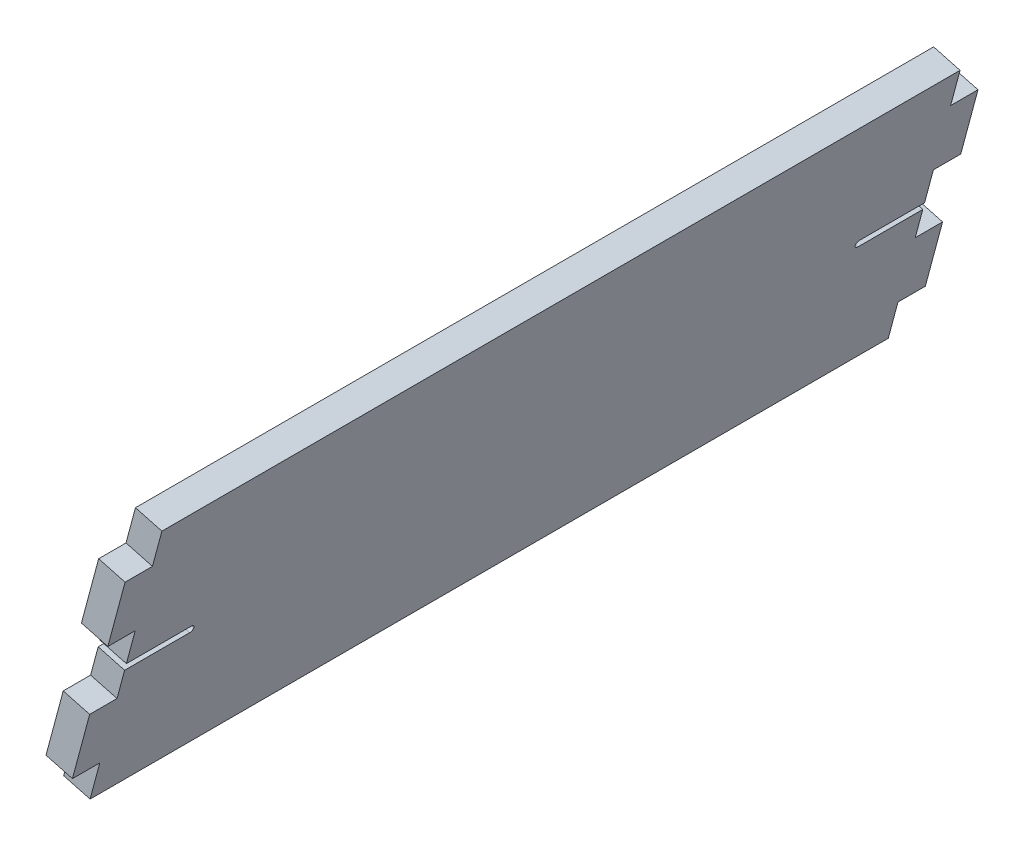
ISO-10303-21;
HEADER;
FILE_DESCRIPTION(('STEP AP214'),'2;1');
FILE_NAME('part.step','',(''),(''),'','','');
FILE_SCHEMA(('AUTOMOTIVE_DESIGN { 1 0 10303 214 1 1 1 1 }'));
ENDSEC;
DATA;
#1=APPLICATION_CONTEXT('core data for automotive mechanical design processes');
#2=APPLICATION_PROTOCOL_DEFINITION('international standard','automotive_design',2000,#1);
#3=PRODUCT_CONTEXT('',#1,'mechanical');
#4=PRODUCT('Part','Part','',(#3));
#5=PRODUCT_RELATED_PRODUCT_CATEGORY('part','',(#4));
#6=PRODUCT_DEFINITION_FORMATION('','',#4);
#7=PRODUCT_DEFINITION_CONTEXT('part definition',#1,'design');
#8=PRODUCT_DEFINITION('design','',#6,#7);
#9=PRODUCT_DEFINITION_SHAPE('','',#8);
#10=(LENGTH_UNIT() NAMED_UNIT(*) SI_UNIT(.MILLI.,.METRE.));
#11=(NAMED_UNIT(*) PLANE_ANGLE_UNIT() SI_UNIT($,.RADIAN.));
#12=(NAMED_UNIT(*) SI_UNIT($,.STERADIAN.) SOLID_ANGLE_UNIT());
#13=UNCERTAINTY_MEASURE_WITH_UNIT(LENGTH_MEASURE(1.E-05),#10,'distance_accuracy_value','');
#14=(GEOMETRIC_REPRESENTATION_CONTEXT(3) GLOBAL_UNCERTAINTY_ASSIGNED_CONTEXT((#13)) GLOBAL_UNIT_ASSIGNED_CONTEXT((#10,
#11,#12)) REPRESENTATION_CONTEXT('',''));
#15=CARTESIAN_POINT('',(0.,0.,0.));
#16=DIRECTION('',(0.,0.,1.));
#17=DIRECTION('',(1.,0.,0.));
#18=AXIS2_PLACEMENT_3D('',#15,#16,#17);
#19=CARTESIAN_POINT('',(0.,0.,0.));
#20=DIRECTION('',(0.,0.,1.));
#21=DIRECTION('',(1.,0.,0.));
#22=AXIS2_PLACEMENT_3D('',#19,#20,#21);
#23=PLANE('',#22);
#24=DIRECTION('',(-0.258819045102525,-0.965925826289067,0.));
#25=VECTOR('',#24,1.);
#26=CARTESIAN_POINT('',(-147.675554957734,-104.690957107632,0.));
#27=LINE('',#26,#25);
#28=CARTESIAN_POINT('',(-161.288227208207,-155.494141573177,0.));
#29=VERTEX_POINT('',#28);
#30=CARTESIAN_POINT('',(-163.419212172312,-163.447085729385,0.));
#31=VERTEX_POINT('',#30);
#32=EDGE_CURVE('E281',#29,#31,#27,.T.);
#33=ORIENTED_EDGE('',*,*,#32,.F.);
#34=DIRECTION('',(-0.965925826289067,0.258819045102525,0.));
#35=VECTOR('',#34,1.);
#36=CARTESIAN_POINT('',(-155.492672250472,-157.047055843792,0.));
#37=LINE('',#36,#35);
#38=CARTESIAN_POINT('',(-155.492672250472,-157.047055843792,0.));
#39=VERTEX_POINT('',#38);
#40=EDGE_CURVE('E396',#39,#29,#37,.T.);
#41=ORIENTED_EDGE('',*,*,#40,.F.);
#42=DIRECTION('',(0.258819045102526,0.965925826289067,0.));
#43=VECTOR('',#42,1.);
#44=CARTESIAN_POINT('',(-157.623657214578,-165.,0.));
#45=LINE('',#44,#43);
#46=CARTESIAN_POINT('',(-157.623657214578,-165.,0.));
#47=VERTEX_POINT('',#46);
#48=EDGE_CURVE('E258',#47,#39,#45,.T.);
#49=ORIENTED_EDGE('',*,*,#48,.F.);
#50=DIRECTION('',(0.965925826289066,-0.258819045102527,0.));
#51=VECTOR('',#50,1.);
#52=CARTESIAN_POINT('',(-163.419212172312,-163.447085729385,0.));
#53=LINE('',#52,#51);
#54=EDGE_CURVE('E267',#31,#47,#53,.T.);
#55=ORIENTED_EDGE('',*,*,#54,.F.);
#56=EDGE_LOOP('',(#33,#41,#49,#55));
#57=FACE_BOUND('',#56,.T.);
#58=ADVANCED_FACE('F33',(#57),#23,.F.);
#59=CARTESIAN_POINT('',(-153.523655855131,-126.516366784505,0.));
#60=VERTEX_POINT('',#59);
#61=CARTESIAN_POINT('',(-155.459299973339,-133.74028897903,0.));
#62=VERTEX_POINT('',#61);
#63=EDGE_CURVE('E279',#60,#62,#27,.T.);
#64=ORIENTED_EDGE('',*,*,#63,.F.);
#65=DIRECTION('',(-0.965925826289067,0.258819045102525,0.));
#66=VECTOR('',#65,1.);
#67=CARTESIAN_POINT('',(-147.728100897397,-128.06928105512,0.));
#68=LINE('',#67,#66);
#69=CARTESIAN_POINT('',(-147.728100897397,-128.06928105512,0.));
#70=VERTEX_POINT('',#69);
#71=EDGE_CURVE('E387',#70,#60,#68,.T.);
#72=ORIENTED_EDGE('',*,*,#71,.F.);
#73=CARTESIAN_POINT('',(-149.663745015605,-135.293203249645,0.));
#74=VERTEX_POINT('',#73);
#75=EDGE_CURVE('E259',#74,#70,#45,.T.);
#76=ORIENTED_EDGE('',*,*,#75,.F.);
#77=DIRECTION('',(0.965925826289067,-0.258819045102525,0.));
#78=VECTOR('',#77,1.);
#79=CARTESIAN_POINT('',(-43.8488707156993,-163.646213365506,0.));
#80=LINE('',#79,#78);
#81=EDGE_CURVE('E431',#62,#74,#80,.T.);
#82=ORIENTED_EDGE('',*,*,#81,.F.);
#83=EDGE_LOOP('',(#64,#72,#76,#82));
#84=FACE_BOUND('',#83,.T.);
#85=ADVANCED_FACE('F436',(#84),#23,.F.);
#86=CARTESIAN_POINT('',(-147.675554957734,-104.690957107632,175.));
#87=DIRECTION('',(0.965925826289067,-0.258819045102525,0.));
#88=DIRECTION('',(0.258819045102525,0.965925826289067,0.));
#89=AXIS2_PLACEMENT_3D('',#86,#87,#88);
#90=PLANE('',#89);
#91=DIRECTION('',(0.,0.,1.));
#92=VECTOR('',#91,1.);
#93=CARTESIAN_POINT('',(-155.459299973339,-133.74028897903,-3.));
#94=LINE('',#93,#92);
#95=CARTESIAN_POINT('',(-155.459299973339,-133.74028897903,14.25));
#96=VERTEX_POINT('',#95);
#97=EDGE_CURVE('E369',#62,#96,#94,.T.);
#98=ORIENTED_EDGE('',*,*,#97,.T.);
#99=CARTESIAN_POINT('',(-155.653414257166,-134.464733348747,14.25));
#100=DIRECTION('',(0.965925826289067,-0.258819045102525,0.));
#101=DIRECTION('',(0.258819045102525,0.965925826289067,0.));
#102=AXIS2_PLACEMENT_3D('',#99,#100,#101);
#103=CIRCLE('',#102,0.75);
#104=CARTESIAN_POINT('',(-155.653414257166,-134.464733348747,15.));
#105=VERTEX_POINT('',#104);
#106=EDGE_CURVE('E42',#96,#105,#103,.T.);
#107=ORIENTED_EDGE('',*,*,#106,.T.);
#108=CARTESIAN_POINT('',(-155.653414257166,-134.464733348747,14.25));
#109=DIRECTION('',(0.965925826289067,-0.258819045102525,0.));
#110=DIRECTION('',(0.258819045102525,0.965925826289067,0.));
#111=AXIS2_PLACEMENT_3D('',#108,#109,#110);
#112=CIRCLE('',#111,0.75);
#113=CARTESIAN_POINT('',(-155.847528540993,-135.189177718464,14.25));
#114=VERTEX_POINT('',#113);
#115=EDGE_CURVE('E461',#105,#114,#112,.T.);
#116=ORIENTED_EDGE('',*,*,#115,.T.);
#117=DIRECTION('',(0.,0.,-1.));
#118=VECTOR('',#117,1.);
#119=CARTESIAN_POINT('',(-155.847528540993,-135.189177718464,-3.));
#120=LINE('',#119,#118);
#121=CARTESIAN_POINT('',(-155.847528540993,-135.189177718464,0.));
#122=VERTEX_POINT('',#121);
#123=EDGE_CURVE('E373',#114,#122,#120,.T.);
#124=ORIENTED_EDGE('',*,*,#123,.T.);
#125=CARTESIAN_POINT('',(-157.50946914971,-141.391624509356,0.));
#126=VERTEX_POINT('',#125);
#127=EDGE_CURVE('E282',#122,#126,#27,.T.);
#128=ORIENTED_EDGE('',*,*,#127,.T.);
#129=DIRECTION('',(0.,0.,-1.));
#130=VECTOR('',#129,1.);
#131=CARTESIAN_POINT('',(-157.50946914971,-141.391624509356,0.));
#132=LINE('',#131,#130);
#133=CARTESIAN_POINT('',(-157.50946914971,-141.391624509356,-6.));
#134=VERTEX_POINT('',#133);
#135=EDGE_CURVE('E236',#126,#134,#132,.T.);
#136=ORIENTED_EDGE('',*,*,#135,.T.);
#137=DIRECTION('',(-0.258819045102526,-0.965925826289067,0.));
#138=VECTOR('',#137,1.);
#139=CARTESIAN_POINT('',(-157.50946914971,-141.391624509356,-6.));
#140=LINE('',#139,#138);
#141=CARTESIAN_POINT('',(-161.288227208207,-155.494141573177,-6.));
#142=VERTEX_POINT('',#141);
#143=EDGE_CURVE('E408',#134,#142,#140,.T.);
#144=ORIENTED_EDGE('',*,*,#143,.T.);
#145=DIRECTION('',(0.,0.,1.));
#146=VECTOR('',#145,1.);
#147=CARTESIAN_POINT('',(-161.288227208207,-155.494141573177,0.));
#148=LINE('',#147,#146);
#149=EDGE_CURVE('E49',#142,#29,#148,.T.);
#150=ORIENTED_EDGE('',*,*,#149,.T.);
#151=ORIENTED_EDGE('',*,*,#32,.T.);
#152=DIRECTION('',(0.,0.,-1.));
#153=VECTOR('',#152,1.);
#154=CARTESIAN_POINT('',(-163.419212172312,-163.447085729385,175.));
#155=LINE('',#154,#153);
#156=CARTESIAN_POINT('',(-163.419212172312,-163.447085729385,175.));
#157=VERTEX_POINT('',#156);
#158=EDGE_CURVE('E495',#157,#31,#155,.T.);
#159=ORIENTED_EDGE('',*,*,#158,.F.);
#160=DIRECTION('',(-0.258819045102525,-0.965925826289067,0.));
#161=VECTOR('',#160,1.);
#162=CARTESIAN_POINT('',(-147.675554957734,-104.690957107632,175.));
#163=LINE('',#162,#161);
#164=CARTESIAN_POINT('',(-161.288227208207,-155.494141573177,175.));
#165=VERTEX_POINT('',#164);
#166=EDGE_CURVE('E300',#165,#157,#163,.T.);
#167=ORIENTED_EDGE('',*,*,#166,.F.);
#168=DIRECTION('',(0.,0.,-1.));
#169=VECTOR('',#168,1.);
#170=CARTESIAN_POINT('',(-161.288227208207,-155.494141573177,181.));
#171=LINE('',#170,#169);
#172=CARTESIAN_POINT('',(-161.288227208207,-155.494141573177,181.));
#173=VERTEX_POINT('',#172);
#174=EDGE_CURVE('E287',#173,#165,#171,.T.);
#175=ORIENTED_EDGE('',*,*,#174,.F.);
#176=DIRECTION('',(-0.258819045102525,-0.965925826289067,0.));
#177=VECTOR('',#176,1.);
#178=CARTESIAN_POINT('',(-111.61042925764,29.9059243864761,181.));
#179=LINE('',#178,#177);
#180=CARTESIAN_POINT('',(-157.50946914971,-141.391624509356,181.));
#181=VERTEX_POINT('',#180);
#182=EDGE_CURVE('E317',#181,#173,#179,.T.);
#183=ORIENTED_EDGE('',*,*,#182,.F.);
#184=DIRECTION('',(0.,0.,-1.));
#185=VECTOR('',#184,1.);
#186=CARTESIAN_POINT('',(-157.50946914971,-141.391624509356,181.));
#187=LINE('',#186,#185);
#188=CARTESIAN_POINT('',(-157.50946914971,-141.391624509356,175.));
#189=VERTEX_POINT('',#188);
#190=EDGE_CURVE('E311',#181,#189,#187,.T.);
#191=ORIENTED_EDGE('',*,*,#190,.T.);
#192=CARTESIAN_POINT('',(-155.847528540993,-135.189177718464,175.));
#193=VERTEX_POINT('',#192);
#194=EDGE_CURVE('E299',#193,#189,#163,.T.);
#195=ORIENTED_EDGE('',*,*,#194,.F.);
#196=DIRECTION('',(0.,0.,1.));
#197=VECTOR('',#196,1.);
#198=CARTESIAN_POINT('',(-155.847528540993,-135.189177718464,178.));
#199=LINE('',#198,#197);
#200=CARTESIAN_POINT('',(-155.847528540993,-135.189177718464,160.75));
#201=VERTEX_POINT('',#200);
#202=EDGE_CURVE('E362',#201,#193,#199,.T.);
#203=ORIENTED_EDGE('',*,*,#202,.F.);
#204=CARTESIAN_POINT('',(-155.653414257166,-134.464733348747,160.75));
#205=DIRECTION('',(0.965925826289067,-0.258819045102525,0.));
#206=DIRECTION('',(0.258819045102525,0.965925826289067,0.));
#207=AXIS2_PLACEMENT_3D('',#204,#205,#206);
#208=CIRCLE('',#207,0.75);
#209=CARTESIAN_POINT('',(-155.653414257166,-134.464733348747,160.));
#210=VERTEX_POINT('',#209);
#211=EDGE_CURVE('E447',#201,#210,#208,.T.);
#212=ORIENTED_EDGE('',*,*,#211,.T.);
#213=CARTESIAN_POINT('',(-155.653414257166,-134.464733348747,160.75));
#214=DIRECTION('',(0.965925826289067,-0.258819045102525,0.));
#215=DIRECTION('',(0.258819045102525,0.965925826289067,0.));
#216=AXIS2_PLACEMENT_3D('',#213,#214,#215);
#217=CIRCLE('',#216,0.75);
#218=CARTESIAN_POINT('',(-155.459299973339,-133.74028897903,160.75));
#219=VERTEX_POINT('',#218);
#220=EDGE_CURVE('E451',#210,#219,#217,.T.);
#221=ORIENTED_EDGE('',*,*,#220,.T.);
#222=DIRECTION('',(0.,0.,-1.));
#223=VECTOR('',#222,1.);
#224=CARTESIAN_POINT('',(-155.459299973339,-133.74028897903,178.));
#225=LINE('',#224,#223);
#226=CARTESIAN_POINT('',(-155.459299973339,-133.74028897903,175.));
#227=VERTEX_POINT('',#226);
#228=EDGE_CURVE('E364',#227,#219,#225,.T.);
#229=ORIENTED_EDGE('',*,*,#228,.F.);
#230=CARTESIAN_POINT('',(-153.523655855131,-126.516366784505,175.));
#231=VERTEX_POINT('',#230);
#232=EDGE_CURVE('E298',#231,#227,#163,.T.);
#233=ORIENTED_EDGE('',*,*,#232,.F.);
#234=DIRECTION('',(0.,0.,-1.));
#235=VECTOR('',#234,1.);
#236=CARTESIAN_POINT('',(-153.523655855131,-126.516366784505,181.));
#237=LINE('',#236,#235);
#238=CARTESIAN_POINT('',(-153.523655855131,-126.516366784505,181.));
#239=VERTEX_POINT('',#238);
#240=EDGE_CURVE('E332',#239,#231,#237,.T.);
#241=ORIENTED_EDGE('',*,*,#240,.F.);
#242=DIRECTION('',(-0.258819045102525,-0.965925826289067,0.));
#243=VECTOR('',#242,1.);
#244=CARTESIAN_POINT('',(-111.61042925764,29.9059243864761,181.));
#245=LINE('',#244,#243);
#246=CARTESIAN_POINT('',(-149.744897796634,-112.413849720684,181.));
#247=VERTEX_POINT('',#246);
#248=EDGE_CURVE('E353',#247,#239,#245,.T.);
#249=ORIENTED_EDGE('',*,*,#248,.F.);
#250=DIRECTION('',(0.,0.,-1.));
#251=VECTOR('',#250,1.);
#252=CARTESIAN_POINT('',(-149.744897796634,-112.413849720684,181.));
#253=LINE('',#252,#251);
#254=CARTESIAN_POINT('',(-149.744897796634,-112.413849720684,175.));
#255=VERTEX_POINT('',#254);
#256=EDGE_CURVE('E321',#247,#255,#253,.T.);
#257=ORIENTED_EDGE('',*,*,#256,.T.);
#258=CARTESIAN_POINT('',(-147.675554957734,-104.690957107632,175.));
#259=VERTEX_POINT('',#258);
#260=EDGE_CURVE('E296',#259,#255,#163,.T.);
#261=ORIENTED_EDGE('',*,*,#260,.F.);
#262=DIRECTION('',(0.,0.,-1.));
#263=VECTOR('',#262,1.);
#264=CARTESIAN_POINT('',(-147.675554957734,-104.690957107632,175.));
#265=LINE('',#264,#263);
#266=CARTESIAN_POINT('',(-147.675554957734,-104.690957107632,0.));
#267=VERTEX_POINT('',#266);
#268=EDGE_CURVE('E493',#259,#267,#265,.T.);
#269=ORIENTED_EDGE('',*,*,#268,.T.);
#270=CARTESIAN_POINT('',(-149.744897796634,-112.413849720684,0.));
#271=VERTEX_POINT('',#270);
#272=EDGE_CURVE('E272',#267,#271,#27,.T.);
#273=ORIENTED_EDGE('',*,*,#272,.T.);
#274=DIRECTION('',(0.,0.,-1.));
#275=VECTOR('',#274,1.);
#276=CARTESIAN_POINT('',(-149.744897796634,-112.413849720684,0.));
#277=LINE('',#276,#275);
#278=CARTESIAN_POINT('',(-149.744897796634,-112.413849720684,-6.00000000000001));
#279=VERTEX_POINT('',#278);
#280=EDGE_CURVE('E393',#271,#279,#277,.T.);
#281=ORIENTED_EDGE('',*,*,#280,.T.);
#282=DIRECTION('',(-0.258819045102524,-0.965925826289067,0.));
#283=VECTOR('',#282,1.);
#284=CARTESIAN_POINT('',(-149.744897796634,-112.413849720684,-6.00000000000001));
#285=LINE('',#284,#283);
#286=CARTESIAN_POINT('',(-153.523655855131,-126.516366784505,-6.));
#287=VERTEX_POINT('',#286);
#288=EDGE_CURVE('E391',#279,#287,#285,.T.);
#289=ORIENTED_EDGE('',*,*,#288,.T.);
#290=DIRECTION('',(0.,0.,1.));
#291=VECTOR('',#290,1.);
#292=CARTESIAN_POINT('',(-153.523655855131,-126.516366784505,0.));
#293=LINE('',#292,#291);
#294=EDGE_CURVE('E56',#287,#60,#293,.T.);
#295=ORIENTED_EDGE('',*,*,#294,.T.);
#296=ORIENTED_EDGE('',*,*,#63,.T.);
#297=EDGE_LOOP('',(#98,#107,#116,#124,#128,#136,#144,#150,#151,#159,#167,#175,#183,#191,#195,
#203,#212,#221,#229,#233,#241,#249,#257,#261,#269,#273,#281,#289,#295,#296));
#298=FACE_BOUND('',#297,.T.);
#299=ADVANCED_FACE('F424',(#298),#90,.F.);
#300=CARTESIAN_POINT('',(-157.623657214578,-165.,175.));
#301=DIRECTION('',(-0.965925826289067,0.258819045102526,0.));
#302=DIRECTION('',(-0.258819045102526,-0.965925826289067,0.));
#303=AXIS2_PLACEMENT_3D('',#300,#301,#302);
#304=PLANE('',#303);
#305=CARTESIAN_POINT('',(-149.857859299432,-136.017647619362,14.25));
#306=DIRECTION('',(-0.965925826289067,0.258819045102526,0.));
#307=DIRECTION('',(-0.258819045102526,-0.965925826289067,0.));
#308=AXIS2_PLACEMENT_3D('',#305,#306,#307);
#309=CIRCLE('',#308,0.75);
#310=CARTESIAN_POINT('',(-150.051973583259,-136.742091989079,14.25));
#311=VERTEX_POINT('',#310);
#312=CARTESIAN_POINT('',(-149.857859299432,-136.017647619362,15.));
#313=VERTEX_POINT('',#312);
#314=EDGE_CURVE('E463',#311,#313,#309,.T.);
#315=ORIENTED_EDGE('',*,*,#314,.T.);
#316=CARTESIAN_POINT('',(-149.857859299432,-136.017647619362,14.25));
#317=DIRECTION('',(-0.965925826289067,0.258819045102526,0.));
#318=DIRECTION('',(-0.258819045102526,-0.965925826289067,0.));
#319=AXIS2_PLACEMENT_3D('',#316,#317,#318);
#320=CIRCLE('',#319,0.75);
#321=CARTESIAN_POINT('',(-149.663745015605,-135.293203249645,14.25));
#322=VERTEX_POINT('',#321);
#323=EDGE_CURVE('E11',#313,#322,#320,.T.);
#324=ORIENTED_EDGE('',*,*,#323,.T.);
#325=DIRECTION('',(0.,0.,1.));
#326=VECTOR('',#325,1.);
#327=CARTESIAN_POINT('',(-149.663745015605,-135.293203249645,-3.));
#328=LINE('',#327,#326);
#329=EDGE_CURVE('E367',#74,#322,#328,.T.);
#330=ORIENTED_EDGE('',*,*,#329,.F.);
#331=ORIENTED_EDGE('',*,*,#75,.T.);
#332=DIRECTION('',(0.,0.,1.));
#333=VECTOR('',#332,1.);
#334=CARTESIAN_POINT('',(-147.728100897397,-128.06928105512,0.));
#335=LINE('',#334,#333);
#336=CARTESIAN_POINT('',(-147.728100897397,-128.06928105512,-6.));
#337=VERTEX_POINT('',#336);
#338=EDGE_CURVE('E383',#337,#70,#335,.T.);
#339=ORIENTED_EDGE('',*,*,#338,.F.);
#340=DIRECTION('',(-0.258819045102524,-0.965925826289067,0.));
#341=VECTOR('',#340,1.);
#342=CARTESIAN_POINT('',(-143.9493428389,-113.966763991299,-6.00000000000001));
#343=LINE('',#342,#341);
#344=CARTESIAN_POINT('',(-143.9493428389,-113.966763991299,-6.00000000000001));
#345=VERTEX_POINT('',#344);
#346=EDGE_CURVE('E398',#345,#337,#343,.T.);
#347=ORIENTED_EDGE('',*,*,#346,.F.);
#348=DIRECTION('',(0.,0.,-1.));
#349=VECTOR('',#348,1.);
#350=CARTESIAN_POINT('',(-143.9493428389,-113.966763991299,0.));
#351=LINE('',#350,#349);
#352=CARTESIAN_POINT('',(-143.9493428389,-113.966763991299,0.));
#353=VERTEX_POINT('',#352);
#354=EDGE_CURVE('E390',#353,#345,#351,.T.);
#355=ORIENTED_EDGE('',*,*,#354,.F.);
#356=CARTESIAN_POINT('',(-141.88,-106.243871378248,0.));
#357=VERTEX_POINT('',#356);
#358=EDGE_CURVE('E261',#353,#357,#45,.T.);
#359=ORIENTED_EDGE('',*,*,#358,.T.);
#360=DIRECTION('',(0.,0.,-1.));
#361=VECTOR('',#360,1.);
#362=CARTESIAN_POINT('',(-141.88,-106.243871378248,175.));
#363=LINE('',#362,#361);
#364=CARTESIAN_POINT('',(-141.88,-106.243871378248,175.));
#365=VERTEX_POINT('',#364);
#366=EDGE_CURVE('E290',#365,#357,#363,.T.);
#367=ORIENTED_EDGE('',*,*,#366,.F.);
#368=DIRECTION('',(0.258819045102526,0.965925826289067,0.));
#369=VECTOR('',#368,1.);
#370=CARTESIAN_POINT('',(-157.623657214578,-165.,175.));
#371=LINE('',#370,#369);
#372=CARTESIAN_POINT('',(-143.9493428389,-113.966763991299,175.));
#373=VERTEX_POINT('',#372);
#374=EDGE_CURVE('E295',#373,#365,#371,.T.);
#375=ORIENTED_EDGE('',*,*,#374,.F.);
#376=DIRECTION('',(0.,0.,-1.));
#377=VECTOR('',#376,1.);
#378=CARTESIAN_POINT('',(-143.9493428389,-113.966763991299,181.));
#379=LINE('',#378,#377);
#380=CARTESIAN_POINT('',(-143.9493428389,-113.966763991299,181.));
#381=VERTEX_POINT('',#380);
#382=EDGE_CURVE('E338',#381,#373,#379,.T.);
#383=ORIENTED_EDGE('',*,*,#382,.F.);
#384=DIRECTION('',(0.258819045102526,0.965925826289067,0.));
#385=VECTOR('',#384,1.);
#386=CARTESIAN_POINT('',(-105.814874299905,28.353010115861,181.));
#387=LINE('',#386,#385);
#388=CARTESIAN_POINT('',(-147.728100897397,-128.06928105512,181.));
#389=VERTEX_POINT('',#388);
#390=EDGE_CURVE('E341',#389,#381,#387,.T.);
#391=ORIENTED_EDGE('',*,*,#390,.F.);
#392=DIRECTION('',(0.,0.,-1.));
#393=VECTOR('',#392,1.);
#394=CARTESIAN_POINT('',(-147.728100897397,-128.06928105512,181.));
#395=LINE('',#394,#393);
#396=CARTESIAN_POINT('',(-147.728100897397,-128.06928105512,175.));
#397=VERTEX_POINT('',#396);
#398=EDGE_CURVE('E335',#389,#397,#395,.T.);
#399=ORIENTED_EDGE('',*,*,#398,.T.);
#400=CARTESIAN_POINT('',(-149.663745015605,-135.293203249645,175.));
#401=VERTEX_POINT('',#400);
#402=EDGE_CURVE('E292',#401,#397,#371,.T.);
#403=ORIENTED_EDGE('',*,*,#402,.F.);
#404=DIRECTION('',(0.,0.,-1.));
#405=VECTOR('',#404,1.);
#406=CARTESIAN_POINT('',(-149.663745015605,-135.293203249645,175.));
#407=LINE('',#406,#405);
#408=CARTESIAN_POINT('',(-149.663745015605,-135.293203249645,160.75));
#409=VERTEX_POINT('',#408);
#410=EDGE_CURVE('E442',#401,#409,#407,.T.);
#411=ORIENTED_EDGE('',*,*,#410,.T.);
#412=CARTESIAN_POINT('',(-149.857859299432,-136.017647619362,160.75));
#413=DIRECTION('',(-0.965925826289067,0.258819045102526,0.));
#414=DIRECTION('',(-0.258819045102526,-0.965925826289067,0.));
#415=AXIS2_PLACEMENT_3D('',#412,#413,#414);
#416=CIRCLE('',#415,0.75);
#417=CARTESIAN_POINT('',(-149.857859299432,-136.017647619362,160.));
#418=VERTEX_POINT('',#417);
#419=EDGE_CURVE('E453',#409,#418,#416,.T.);
#420=ORIENTED_EDGE('',*,*,#419,.T.);
#421=CARTESIAN_POINT('',(-149.857859299432,-136.017647619362,160.75));
#422=DIRECTION('',(-0.965925826289067,0.258819045102526,0.));
#423=DIRECTION('',(-0.258819045102526,-0.965925826289067,0.));
#424=AXIS2_PLACEMENT_3D('',#421,#422,#423);
#425=CIRCLE('',#424,0.75);
#426=CARTESIAN_POINT('',(-150.051973583259,-136.742091989079,160.75));
#427=VERTEX_POINT('',#426);
#428=EDGE_CURVE('E449',#418,#427,#425,.T.);
#429=ORIENTED_EDGE('',*,*,#428,.T.);
#430=DIRECTION('',(0.,0.,1.));
#431=VECTOR('',#430,1.);
#432=CARTESIAN_POINT('',(-150.051973583259,-136.742091989079,178.));
#433=LINE('',#432,#431);
#434=CARTESIAN_POINT('',(-150.051973583259,-136.742091989079,175.));
#435=VERTEX_POINT('',#434);
#436=EDGE_CURVE('E361',#427,#435,#433,.T.);
#437=ORIENTED_EDGE('',*,*,#436,.T.);
#438=CARTESIAN_POINT('',(-151.713914191975,-142.944538779971,175.));
#439=VERTEX_POINT('',#438);
#440=EDGE_CURVE('E291',#439,#435,#371,.T.);
#441=ORIENTED_EDGE('',*,*,#440,.F.);
#442=DIRECTION('',(0.,0.,-1.));
#443=VECTOR('',#442,1.);
#444=CARTESIAN_POINT('',(-151.713914191975,-142.944538779971,181.));
#445=LINE('',#444,#443);
#446=CARTESIAN_POINT('',(-151.713914191975,-142.944538779971,181.));
#447=VERTEX_POINT('',#446);
#448=EDGE_CURVE('E308',#447,#439,#445,.T.);
#449=ORIENTED_EDGE('',*,*,#448,.F.);
#450=DIRECTION('',(0.258819045102526,0.965925826289067,0.));
#451=VECTOR('',#450,1.);
#452=CARTESIAN_POINT('',(-105.814874299905,28.353010115861,181.));
#453=LINE('',#452,#451);
#454=CARTESIAN_POINT('',(-155.492672250472,-157.047055843792,181.));
#455=VERTEX_POINT('',#454);
#456=EDGE_CURVE('E324',#455,#447,#453,.T.);
#457=ORIENTED_EDGE('',*,*,#456,.F.);
#458=DIRECTION('',(0.,0.,-1.));
#459=VECTOR('',#458,1.);
#460=CARTESIAN_POINT('',(-155.492672250472,-157.047055843792,181.));
#461=LINE('',#460,#459);
#462=CARTESIAN_POINT('',(-155.492672250472,-157.047055843792,175.));
#463=VERTEX_POINT('',#462);
#464=EDGE_CURVE('E305',#455,#463,#461,.T.);
#465=ORIENTED_EDGE('',*,*,#464,.T.);
#466=CARTESIAN_POINT('',(-157.623657214578,-165.,175.));
#467=VERTEX_POINT('',#466);
#468=EDGE_CURVE('E288',#467,#463,#371,.T.);
#469=ORIENTED_EDGE('',*,*,#468,.F.);
#470=DIRECTION('',(0.,0.,-1.));
#471=VECTOR('',#470,1.);
#472=CARTESIAN_POINT('',(-157.623657214578,-165.,175.));
#473=LINE('',#472,#471);
#474=EDGE_CURVE('E494',#467,#47,#473,.T.);
#475=ORIENTED_EDGE('',*,*,#474,.T.);
#476=ORIENTED_EDGE('',*,*,#48,.T.);
#477=DIRECTION('',(0.,0.,1.));
#478=VECTOR('',#477,1.);
#479=CARTESIAN_POINT('',(-155.492672250472,-157.047055843792,0.));
#480=LINE('',#479,#478);
#481=CARTESIAN_POINT('',(-155.492672250472,-157.047055843792,-6.));
#482=VERTEX_POINT('',#481);
#483=EDGE_CURVE('E242',#482,#39,#480,.T.);
#484=ORIENTED_EDGE('',*,*,#483,.F.);
#485=DIRECTION('',(-0.258819045102526,-0.965925826289067,0.));
#486=VECTOR('',#485,1.);
#487=CARTESIAN_POINT('',(-151.713914191975,-142.944538779971,-6.));
#488=LINE('',#487,#486);
#489=CARTESIAN_POINT('',(-151.713914191975,-142.944538779971,-6.));
#490=VERTEX_POINT('',#489);
#491=EDGE_CURVE('E252',#490,#482,#488,.T.);
#492=ORIENTED_EDGE('',*,*,#491,.F.);
#493=DIRECTION('',(0.,0.,-1.));
#494=VECTOR('',#493,1.);
#495=CARTESIAN_POINT('',(-151.713914191975,-142.944538779971,0.));
#496=LINE('',#495,#494);
#497=CARTESIAN_POINT('',(-151.713914191975,-142.944538779971,0.));
#498=VERTEX_POINT('',#497);
#499=EDGE_CURVE('E234',#498,#490,#496,.T.);
#500=ORIENTED_EDGE('',*,*,#499,.F.);
#501=CARTESIAN_POINT('',(-150.051973583259,-136.742091989079,0.));
#502=VERTEX_POINT('',#501);
#503=EDGE_CURVE('E248',#498,#502,#45,.T.);
#504=ORIENTED_EDGE('',*,*,#503,.T.);
#505=DIRECTION('',(0.,0.,-1.));
#506=VECTOR('',#505,1.);
#507=CARTESIAN_POINT('',(-150.051973583259,-136.742091989079,-3.));
#508=LINE('',#507,#506);
#509=EDGE_CURVE('E372',#311,#502,#508,.T.);
#510=ORIENTED_EDGE('',*,*,#509,.F.);
#511=EDGE_LOOP('',(#315,#324,#330,#331,#339,#347,#355,#359,#367,#375,#383,#391,#399,#403,#411,
#420,#429,#437,#441,#449,#457,#465,#469,#475,#476,#484,#492,#500,#504,#510));
#512=FACE_BOUND('',#511,.T.);
#513=ADVANCED_FACE('F246',(#512),#304,.F.);
#514=ORIENTED_EDGE('',*,*,#358,.F.);
#515=DIRECTION('',(-0.965925826289067,0.258819045102525,0.));
#516=VECTOR('',#515,1.);
#517=CARTESIAN_POINT('',(-143.9493428389,-113.966763991299,0.));
#518=LINE('',#517,#516);
#519=EDGE_CURVE('E379',#353,#271,#518,.T.);
#520=ORIENTED_EDGE('',*,*,#519,.T.);
#521=ORIENTED_EDGE('',*,*,#272,.F.);
#522=DIRECTION('',(-0.965925826289067,0.258819045102525,0.));
#523=VECTOR('',#522,1.);
#524=CARTESIAN_POINT('',(-141.88,-106.243871378248,0.));
#525=LINE('',#524,#523);
#526=EDGE_CURVE('E284',#357,#267,#525,.T.);
#527=ORIENTED_EDGE('',*,*,#526,.F.);
#528=EDGE_LOOP('',(#514,#520,#521,#527));
#529=FACE_BOUND('',#528,.T.);
#530=ADVANCED_FACE('F487',(#529),#23,.F.);
#531=ORIENTED_EDGE('',*,*,#503,.F.);
#532=DIRECTION('',(-0.965925826289067,0.258819045102525,0.));
#533=VECTOR('',#532,1.);
#534=CARTESIAN_POINT('',(-151.713914191975,-142.944538779971,0.));
#535=LINE('',#534,#533);
#536=EDGE_CURVE('E231',#498,#126,#535,.T.);
#537=ORIENTED_EDGE('',*,*,#536,.T.);
#538=ORIENTED_EDGE('',*,*,#127,.F.);
#539=DIRECTION('',(-0.965925826289067,0.258819045102525,0.));
#540=VECTOR('',#539,1.);
#541=CARTESIAN_POINT('',(-44.2370992833531,-165.09510210494,0.));
#542=LINE('',#541,#540);
#543=EDGE_CURVE('E257',#502,#122,#542,.T.);
#544=ORIENTED_EDGE('',*,*,#543,.F.);
#545=EDGE_LOOP('',(#531,#537,#538,#544));
#546=FACE_BOUND('',#545,.T.);
#547=ADVANCED_FACE('F255',(#546),#23,.F.);
#548=CARTESIAN_POINT('',(0.,0.,175.));
#549=DIRECTION('',(0.,0.,1.));
#550=DIRECTION('',(1.,0.,0.));
#551=AXIS2_PLACEMENT_3D('',#548,#549,#550);
#552=PLANE('',#551);
#553=DIRECTION('',(0.965925826289067,-0.258819045102525,0.));
#554=VECTOR('',#553,1.);
#555=CARTESIAN_POINT('',(-44.2370992833531,-165.09510210494,175.));
#556=LINE('',#555,#554);
#557=EDGE_CURVE('E349',#193,#435,#556,.T.);
#558=ORIENTED_EDGE('',*,*,#557,.F.);
#559=ORIENTED_EDGE('',*,*,#194,.T.);
#560=DIRECTION('',(0.965925826289067,-0.258819045102524,0.));
#561=VECTOR('',#560,1.);
#562=CARTESIAN_POINT('',(-45.8990398920697,-171.297548895832,175.));
#563=LINE('',#562,#561);
#564=EDGE_CURVE('E315',#189,#439,#563,.T.);
#565=ORIENTED_EDGE('',*,*,#564,.T.);
#566=ORIENTED_EDGE('',*,*,#440,.T.);
#567=EDGE_LOOP('',(#558,#559,#565,#566));
#568=FACE_BOUND('',#567,.T.);
#569=ADVANCED_FACE('F522',(#568),#552,.T.);
#570=DIRECTION('',(-0.965925826289067,0.258819045102525,0.));
#571=VECTOR('',#570,1.);
#572=CARTESIAN_POINT('',(-43.8488707156993,-163.646213365506,175.));
#573=LINE('',#572,#571);
#574=EDGE_CURVE('E359',#401,#227,#573,.T.);
#575=ORIENTED_EDGE('',*,*,#574,.F.);
#576=ORIENTED_EDGE('',*,*,#402,.T.);
#577=DIRECTION('',(0.965925826289067,-0.258819045102526,0.));
#578=VECTOR('',#577,1.);
#579=CARTESIAN_POINT('',(-41.9132265974911,-156.422291170981,175.));
#580=LINE('',#579,#578);
#581=EDGE_CURVE('E342',#231,#397,#580,.T.);
#582=ORIENTED_EDGE('',*,*,#581,.F.);
#583=ORIENTED_EDGE('',*,*,#232,.T.);
#584=EDGE_LOOP('',(#575,#576,#582,#583));
#585=FACE_BOUND('',#584,.T.);
#586=ADVANCED_FACE('F544',(#585),#552,.T.);
#587=DIRECTION('',(0.965925826289068,-0.258819045102523,0.));
#588=VECTOR('',#587,1.);
#589=CARTESIAN_POINT('',(-38.1344685389938,-142.31977410716,175.));
#590=LINE('',#589,#588);
#591=EDGE_CURVE('E346',#255,#373,#590,.T.);
#592=ORIENTED_EDGE('',*,*,#591,.T.);
#593=ORIENTED_EDGE('',*,*,#374,.T.);
#594=DIRECTION('',(-0.965925826289067,0.258819045102525,0.));
#595=VECTOR('',#594,1.);
#596=CARTESIAN_POINT('',(-141.88,-106.243871378248,175.));
#597=LINE('',#596,#595);
#598=EDGE_CURVE('E263',#365,#259,#597,.T.);
#599=ORIENTED_EDGE('',*,*,#598,.T.);
#600=ORIENTED_EDGE('',*,*,#260,.T.);
#601=EDGE_LOOP('',(#592,#593,#599,#600));
#602=FACE_BOUND('',#601,.T.);
#603=ADVANCED_FACE('F526',(#602),#552,.T.);
#604=CARTESIAN_POINT('',(-141.88,-106.243871378248,175.));
#605=DIRECTION('',(-0.258819045102525,-0.965925826289067,0.));
#606=DIRECTION('',(0.965925826289067,-0.258819045102525,0.));
#607=AXIS2_PLACEMENT_3D('',#604,#605,#606);
#608=PLANE('',#607);
#609=ORIENTED_EDGE('',*,*,#526,.T.);
#610=ORIENTED_EDGE('',*,*,#268,.F.);
#611=ORIENTED_EDGE('',*,*,#598,.F.);
#612=ORIENTED_EDGE('',*,*,#366,.T.);
#613=EDGE_LOOP('',(#609,#610,#611,#612));
#614=FACE_BOUND('',#613,.T.);
#615=ADVANCED_FACE('F491',(#614),#608,.F.);
#616=CARTESIAN_POINT('',(-163.419212172312,-163.447085729385,175.));
#617=DIRECTION('',(0.258819045102527,0.965925826289066,0.));
#618=DIRECTION('',(-0.965925826289067,0.258819045102528,0.));
#619=AXIS2_PLACEMENT_3D('',#616,#617,#618);
#620=PLANE('',#619);
#621=ORIENTED_EDGE('',*,*,#54,.T.);
#622=ORIENTED_EDGE('',*,*,#474,.F.);
#623=DIRECTION('',(0.965925826289066,-0.258819045102527,0.));
#624=VECTOR('',#623,1.);
#625=CARTESIAN_POINT('',(-163.419212172312,-163.447085729385,175.));
#626=LINE('',#625,#624);
#627=EDGE_CURVE('E293',#157,#467,#626,.T.);
#628=ORIENTED_EDGE('',*,*,#627,.F.);
#629=ORIENTED_EDGE('',*,*,#158,.T.);
#630=EDGE_LOOP('',(#621,#622,#628,#629));
#631=FACE_BOUND('',#630,.T.);
#632=ADVANCED_FACE('F551',(#631),#620,.F.);
#633=DIRECTION('',(0.965925826289067,-0.258819045102524,0.));
#634=VECTOR('',#633,1.);
#635=CARTESIAN_POINT('',(-49.6777979505665,-185.400065959653,175.));
#636=LINE('',#635,#634);
#637=EDGE_CURVE('E318',#165,#463,#636,.T.);
#638=ORIENTED_EDGE('',*,*,#637,.F.);
#639=ORIENTED_EDGE('',*,*,#166,.T.);
#640=ORIENTED_EDGE('',*,*,#627,.T.);
#641=ORIENTED_EDGE('',*,*,#468,.T.);
#642=EDGE_LOOP('',(#638,#639,#640,#641));
#643=FACE_BOUND('',#642,.T.);
#644=ADVANCED_FACE('F548',(#643),#552,.T.);
#645=CARTESIAN_POINT('',(-49.6777979505665,-185.400065959653,181.));
#646=DIRECTION('',(0.258819045102524,0.965925826289067,0.));
#647=DIRECTION('',(-0.965925826289067,0.258819045102524,0.));
#648=AXIS2_PLACEMENT_3D('',#645,#646,#647);
#649=PLANE('',#648);
#650=ORIENTED_EDGE('',*,*,#637,.T.);
#651=ORIENTED_EDGE('',*,*,#464,.F.);
#652=DIRECTION('',(0.965925826289067,-0.258819045102524,0.));
#653=VECTOR('',#652,1.);
#654=CARTESIAN_POINT('',(-49.6777979505665,-185.400065959653,181.));
#655=LINE('',#654,#653);
#656=EDGE_CURVE('E326',#173,#455,#655,.T.);
#657=ORIENTED_EDGE('',*,*,#656,.F.);
#658=ORIENTED_EDGE('',*,*,#174,.T.);
#659=EDGE_LOOP('',(#650,#651,#657,#658));
#660=FACE_BOUND('',#659,.T.);
#661=ADVANCED_FACE('F556',(#660),#649,.F.);
#662=CARTESIAN_POINT('',(-45.8990398920697,-171.297548895832,181.));
#663=DIRECTION('',(0.258819045102524,0.965925826289067,0.));
#664=DIRECTION('',(-0.965925826289067,0.258819045102524,0.));
#665=AXIS2_PLACEMENT_3D('',#662,#663,#664);
#666=PLANE('',#665);
#667=ORIENTED_EDGE('',*,*,#564,.F.);
#668=ORIENTED_EDGE('',*,*,#190,.F.);
#669=DIRECTION('',(0.965925826289067,-0.258819045102524,0.));
#670=VECTOR('',#669,1.);
#671=CARTESIAN_POINT('',(-45.8990398920697,-171.297548895832,181.));
#672=LINE('',#671,#670);
#673=EDGE_CURVE('E314',#181,#447,#672,.T.);
#674=ORIENTED_EDGE('',*,*,#673,.T.);
#675=ORIENTED_EDGE('',*,*,#448,.T.);
#676=EDGE_LOOP('',(#667,#668,#674,#675));
#677=FACE_BOUND('',#676,.T.);
#678=ADVANCED_FACE('F562',(#677),#666,.T.);
#679=CARTESIAN_POINT('',(0.,0.,181.));
#680=DIRECTION('',(0.,0.,1.));
#681=DIRECTION('',(1.,0.,0.));
#682=AXIS2_PLACEMENT_3D('',#679,#680,#681);
#683=PLANE('',#682);
#684=ORIENTED_EDGE('',*,*,#182,.T.);
#685=ORIENTED_EDGE('',*,*,#656,.T.);
#686=ORIENTED_EDGE('',*,*,#456,.T.);
#687=ORIENTED_EDGE('',*,*,#673,.F.);
#688=EDGE_LOOP('',(#684,#685,#686,#687));
#689=FACE_BOUND('',#688,.T.);
#690=ADVANCED_FACE('F560',(#689),#683,.T.);
#691=CARTESIAN_POINT('',(-38.1344685389938,-142.31977410716,181.));
#692=DIRECTION('',(0.258819045102523,0.965925826289068,0.));
#693=DIRECTION('',(-0.965925826289068,0.258819045102523,0.));
#694=AXIS2_PLACEMENT_3D('',#691,#692,#693);
#695=PLANE('',#694);
#696=ORIENTED_EDGE('',*,*,#591,.F.);
#697=ORIENTED_EDGE('',*,*,#256,.F.);
#698=DIRECTION('',(0.965925826289068,-0.258819045102523,0.));
#699=VECTOR('',#698,1.);
#700=CARTESIAN_POINT('',(-38.1344685389938,-142.31977410716,181.));
#701=LINE('',#700,#699);
#702=EDGE_CURVE('E345',#247,#381,#701,.T.);
#703=ORIENTED_EDGE('',*,*,#702,.T.);
#704=ORIENTED_EDGE('',*,*,#382,.T.);
#705=EDGE_LOOP('',(#696,#697,#703,#704));
#706=FACE_BOUND('',#705,.T.);
#707=ADVANCED_FACE('F532',(#706),#695,.T.);
#708=CARTESIAN_POINT('',(-41.9132265974911,-156.422291170981,181.));
#709=DIRECTION('',(0.258819045102525,0.965925826289067,0.));
#710=DIRECTION('',(-0.965925826289067,0.258819045102526,0.));
#711=AXIS2_PLACEMENT_3D('',#708,#709,#710);
#712=PLANE('',#711);
#713=ORIENTED_EDGE('',*,*,#581,.T.);
#714=ORIENTED_EDGE('',*,*,#398,.F.);
#715=DIRECTION('',(0.965925826289067,-0.258819045102526,0.));
#716=VECTOR('',#715,1.);
#717=CARTESIAN_POINT('',(-41.9132265974911,-156.422291170981,181.));
#718=LINE('',#717,#716);
#719=EDGE_CURVE('E351',#239,#389,#718,.T.);
#720=ORIENTED_EDGE('',*,*,#719,.F.);
#721=ORIENTED_EDGE('',*,*,#240,.T.);
#722=EDGE_LOOP('',(#713,#714,#720,#721));
#723=FACE_BOUND('',#722,.T.);
#724=ADVANCED_FACE('F540',(#723),#712,.F.);
#725=CARTESIAN_POINT('',(0.,0.,181.));
#726=DIRECTION('',(0.,0.,1.));
#727=DIRECTION('',(1.,0.,0.));
#728=AXIS2_PLACEMENT_3D('',#725,#726,#727);
#729=PLANE('',#728);
#730=ORIENTED_EDGE('',*,*,#702,.F.);
#731=ORIENTED_EDGE('',*,*,#248,.T.);
#732=ORIENTED_EDGE('',*,*,#719,.T.);
#733=ORIENTED_EDGE('',*,*,#390,.T.);
#734=EDGE_LOOP('',(#730,#731,#732,#733));
#735=FACE_BOUND('',#734,.T.);
#736=ADVANCED_FACE('F535',(#735),#729,.T.);
#737=CARTESIAN_POINT('',(-150.051973583259,-136.742091989079,178.));
#738=DIRECTION('',(-0.258819045102525,-0.965925826289067,0.));
#739=DIRECTION('',(0.965925826289067,-0.258819045102525,0.));
#740=AXIS2_PLACEMENT_3D('',#737,#738,#739);
#741=PLANE('',#740);
#742=ORIENTED_EDGE('',*,*,#436,.F.);
#743=DIRECTION('',(-0.965925826289067,0.258819045102525,0.));
#744=VECTOR('',#743,1.);
#745=CARTESIAN_POINT('',(-155.847528540993,-135.189177718464,160.75));
#746=LINE('',#745,#744);
#747=EDGE_CURVE('E437',#427,#201,#746,.T.);
#748=ORIENTED_EDGE('',*,*,#747,.T.);
#749=ORIENTED_EDGE('',*,*,#202,.T.);
#750=ORIENTED_EDGE('',*,*,#557,.T.);
#751=EDGE_LOOP('',(#742,#748,#749,#750));
#752=FACE_BOUND('',#751,.T.);
#753=ADVANCED_FACE('F516',(#752),#741,.F.);
#754=CARTESIAN_POINT('',(-149.663745015605,-135.293203249645,178.));
#755=DIRECTION('',(0.258819045102525,0.965925826289067,0.));
#756=DIRECTION('',(-0.965925826289067,0.258819045102525,0.));
#757=AXIS2_PLACEMENT_3D('',#754,#755,#756);
#758=PLANE('',#757);
#759=ORIENTED_EDGE('',*,*,#228,.T.);
#760=DIRECTION('',(-0.965925826289067,0.258819045102525,0.));
#761=VECTOR('',#760,1.);
#762=CARTESIAN_POINT('',(-149.663745015605,-135.293203249645,160.75));
#763=LINE('',#762,#761);
#764=EDGE_CURVE('E440',#219,#409,#763,.F.);
#765=ORIENTED_EDGE('',*,*,#764,.T.);
#766=ORIENTED_EDGE('',*,*,#410,.F.);
#767=ORIENTED_EDGE('',*,*,#574,.T.);
#768=EDGE_LOOP('',(#759,#765,#766,#767));
#769=FACE_BOUND('',#768,.T.);
#770=ADVANCED_FACE('F623',(#769),#758,.F.);
#771=CARTESIAN_POINT('',(-149.663745015605,-135.293203249645,-3.));
#772=DIRECTION('',(-0.258819045102525,-0.965925826289067,0.));
#773=DIRECTION('',(0.965925826289067,-0.258819045102525,0.));
#774=AXIS2_PLACEMENT_3D('',#771,#772,#773);
#775=PLANE('',#774);
#776=ORIENTED_EDGE('',*,*,#329,.T.);
#777=DIRECTION('',(-0.965925826289067,0.258819045102525,0.));
#778=VECTOR('',#777,1.);
#779=CARTESIAN_POINT('',(-155.459299973339,-133.74028897903,14.25));
#780=LINE('',#779,#778);
#781=EDGE_CURVE('E434',#322,#96,#780,.T.);
#782=ORIENTED_EDGE('',*,*,#781,.T.);
#783=ORIENTED_EDGE('',*,*,#97,.F.);
#784=ORIENTED_EDGE('',*,*,#81,.T.);
#785=EDGE_LOOP('',(#776,#782,#783,#784));
#786=FACE_BOUND('',#785,.T.);
#787=ADVANCED_FACE('F430',(#786),#775,.T.);
#788=CARTESIAN_POINT('',(-150.051973583259,-136.742091989079,-3.));
#789=DIRECTION('',(0.258819045102525,0.965925826289067,0.));
#790=DIRECTION('',(-0.965925826289067,0.258819045102525,0.));
#791=AXIS2_PLACEMENT_3D('',#788,#789,#790);
#792=PLANE('',#791);
#793=ORIENTED_EDGE('',*,*,#123,.F.);
#794=DIRECTION('',(-0.965925826289067,0.258819045102525,0.));
#795=VECTOR('',#794,1.);
#796=CARTESIAN_POINT('',(-150.051973583259,-136.742091989079,14.25));
#797=LINE('',#796,#795);
#798=EDGE_CURVE('E455',#114,#311,#797,.F.);
#799=ORIENTED_EDGE('',*,*,#798,.T.);
#800=ORIENTED_EDGE('',*,*,#509,.T.);
#801=ORIENTED_EDGE('',*,*,#543,.T.);
#802=EDGE_LOOP('',(#793,#799,#800,#801));
#803=FACE_BOUND('',#802,.T.);
#804=ADVANCED_FACE('F475',(#803),#792,.T.);
#805=CARTESIAN_POINT('',(-149.857859299432,-136.017647619362,160.75));
#806=DIRECTION('',(0.965925826289067,-0.258819045102525,0.));
#807=DIRECTION('',(0.258819045102525,0.965925826289067,0.));
#808=AXIS2_PLACEMENT_3D('',#805,#806,#807);
#809=CYLINDRICAL_SURFACE('',#808,0.75);
#810=DIRECTION('',(-0.965925826289067,0.258819045102525,0.));
#811=VECTOR('',#810,1.);
#812=CARTESIAN_POINT('',(-155.653414257166,-134.464733348747,160.));
#813=LINE('',#812,#811);
#814=EDGE_CURVE('E375',#418,#210,#813,.T.);
#815=ORIENTED_EDGE('',*,*,#814,.F.);
#816=ORIENTED_EDGE('',*,*,#419,.F.);
#817=ORIENTED_EDGE('',*,*,#764,.F.);
#818=ORIENTED_EDGE('',*,*,#220,.F.);
#819=EDGE_LOOP('',(#815,#816,#817,#818));
#820=FACE_BOUND('',#819,.T.);
#821=ADVANCED_FACE('F507',(#820),#809,.F.);
#822=CARTESIAN_POINT('',(-149.857859299432,-136.017647619362,160.75));
#823=DIRECTION('',(0.965925826289067,-0.258819045102525,0.));
#824=DIRECTION('',(0.258819045102525,0.965925826289067,0.));
#825=AXIS2_PLACEMENT_3D('',#822,#823,#824);
#826=CYLINDRICAL_SURFACE('',#825,0.75);
#827=ORIENTED_EDGE('',*,*,#428,.F.);
#828=ORIENTED_EDGE('',*,*,#814,.T.);
#829=ORIENTED_EDGE('',*,*,#211,.F.);
#830=ORIENTED_EDGE('',*,*,#747,.F.);
#831=EDGE_LOOP('',(#827,#828,#829,#830));
#832=FACE_BOUND('',#831,.T.);
#833=ADVANCED_FACE('F512',(#832),#826,.F.);
#834=CARTESIAN_POINT('',(-149.857859299432,-136.017647619362,14.25));
#835=DIRECTION('',(0.965925826289067,-0.258819045102525,0.));
#836=DIRECTION('',(0.258819045102525,0.965925826289067,0.));
#837=AXIS2_PLACEMENT_3D('',#834,#835,#836);
#838=CYLINDRICAL_SURFACE('',#837,0.75);
#839=ORIENTED_EDGE('',*,*,#781,.F.);
#840=ORIENTED_EDGE('',*,*,#323,.F.);
#841=DIRECTION('',(-0.965925826289067,0.258819045102525,0.));
#842=VECTOR('',#841,1.);
#843=CARTESIAN_POINT('',(-149.857859299432,-136.017647619362,15.));
#844=LINE('',#843,#842);
#845=EDGE_CURVE('E37',#105,#313,#844,.F.);
#846=ORIENTED_EDGE('',*,*,#845,.F.);
#847=ORIENTED_EDGE('',*,*,#106,.F.);
#848=EDGE_LOOP('',(#839,#840,#846,#847));
#849=FACE_BOUND('',#848,.T.);
#850=ADVANCED_FACE('F35',(#849),#838,.F.);
#851=CARTESIAN_POINT('',(-149.857859299432,-136.017647619362,14.25));
#852=DIRECTION('',(0.965925826289067,-0.258819045102525,0.));
#853=DIRECTION('',(0.258819045102525,0.965925826289067,0.));
#854=AXIS2_PLACEMENT_3D('',#851,#852,#853);
#855=CYLINDRICAL_SURFACE('',#854,0.75);
#856=ORIENTED_EDGE('',*,*,#314,.F.);
#857=ORIENTED_EDGE('',*,*,#798,.F.);
#858=ORIENTED_EDGE('',*,*,#115,.F.);
#859=ORIENTED_EDGE('',*,*,#845,.T.);
#860=EDGE_LOOP('',(#856,#857,#858,#859));
#861=FACE_BOUND('',#860,.T.);
#862=ADVANCED_FACE('F473',(#861),#855,.F.);
#863=CARTESIAN_POINT('',(-147.728100897397,-128.06928105512,0.));
#864=DIRECTION('',(-0.258819045102525,-0.965925826289067,0.));
#865=DIRECTION('',(0.965925826289067,-0.258819045102525,0.));
#866=AXIS2_PLACEMENT_3D('',#863,#864,#865);
#867=PLANE('',#866);
#868=ORIENTED_EDGE('',*,*,#294,.F.);
#869=DIRECTION('',(-0.965925826289067,0.258819045102525,0.));
#870=VECTOR('',#869,1.);
#871=CARTESIAN_POINT('',(-147.728100897397,-128.06928105512,-6.));
#872=LINE('',#871,#870);
#873=EDGE_CURVE('E385',#337,#287,#872,.T.);
#874=ORIENTED_EDGE('',*,*,#873,.F.);
#875=ORIENTED_EDGE('',*,*,#338,.T.);
#876=ORIENTED_EDGE('',*,*,#71,.T.);
#877=EDGE_LOOP('',(#868,#874,#875,#876));
#878=FACE_BOUND('',#877,.T.);
#879=ADVANCED_FACE('F479',(#878),#867,.T.);
#880=CARTESIAN_POINT('',(-143.9493428389,-113.966763991299,-6.00000000000001));
#881=DIRECTION('',(0.,0.,-1.));
#882=DIRECTION('',(0.,1.,0.));
#883=AXIS2_PLACEMENT_3D('',#880,#881,#882);
#884=PLANE('',#883);
#885=ORIENTED_EDGE('',*,*,#288,.F.);
#886=DIRECTION('',(-0.965925826289067,0.258819045102525,0.));
#887=VECTOR('',#886,1.);
#888=CARTESIAN_POINT('',(-143.9493428389,-113.966763991299,-6.00000000000001));
#889=LINE('',#888,#887);
#890=EDGE_CURVE('E382',#345,#279,#889,.T.);
#891=ORIENTED_EDGE('',*,*,#890,.F.);
#892=ORIENTED_EDGE('',*,*,#346,.T.);
#893=ORIENTED_EDGE('',*,*,#873,.T.);
#894=EDGE_LOOP('',(#885,#891,#892,#893));
#895=FACE_BOUND('',#894,.T.);
#896=ADVANCED_FACE('F482',(#895),#884,.T.);
#897=CARTESIAN_POINT('',(-143.9493428389,-113.966763991299,0.));
#898=DIRECTION('',(0.258819045102525,0.965925826289067,0.));
#899=DIRECTION('',(-0.965925826289067,0.258819045102525,0.));
#900=AXIS2_PLACEMENT_3D('',#897,#898,#899);
#901=PLANE('',#900);
#902=ORIENTED_EDGE('',*,*,#280,.F.);
#903=ORIENTED_EDGE('',*,*,#519,.F.);
#904=ORIENTED_EDGE('',*,*,#354,.T.);
#905=ORIENTED_EDGE('',*,*,#890,.T.);
#906=EDGE_LOOP('',(#902,#903,#904,#905));
#907=FACE_BOUND('',#906,.T.);
#908=ADVANCED_FACE('F484',(#907),#901,.T.);
#909=CARTESIAN_POINT('',(-155.492672250472,-157.047055843792,0.));
#910=DIRECTION('',(-0.258819045102525,-0.965925826289067,0.));
#911=DIRECTION('',(0.965925826289067,-0.258819045102525,0.));
#912=AXIS2_PLACEMENT_3D('',#909,#910,#911);
#913=PLANE('',#912);
#914=ORIENTED_EDGE('',*,*,#149,.F.);
#915=DIRECTION('',(-0.965925826289067,0.258819045102525,0.));
#916=VECTOR('',#915,1.);
#917=CARTESIAN_POINT('',(-155.492672250472,-157.047055843792,-6.));
#918=LINE('',#917,#916);
#919=EDGE_CURVE('E404',#482,#142,#918,.T.);
#920=ORIENTED_EDGE('',*,*,#919,.F.);
#921=ORIENTED_EDGE('',*,*,#483,.T.);
#922=ORIENTED_EDGE('',*,*,#40,.T.);
#923=EDGE_LOOP('',(#914,#920,#921,#922));
#924=FACE_BOUND('',#923,.T.);
#925=ADVANCED_FACE('F418',(#924),#913,.T.);
#926=CARTESIAN_POINT('',(-151.713914191975,-142.944538779971,-6.));
#927=DIRECTION('',(0.,0.,-1.));
#928=DIRECTION('',(0.,1.,0.));
#929=AXIS2_PLACEMENT_3D('',#926,#927,#928);
#930=PLANE('',#929);
#931=ORIENTED_EDGE('',*,*,#143,.F.);
#932=DIRECTION('',(-0.965925826289067,0.258819045102525,0.));
#933=VECTOR('',#932,1.);
#934=CARTESIAN_POINT('',(-151.713914191975,-142.944538779971,-6.));
#935=LINE('',#934,#933);
#936=EDGE_CURVE('E241',#490,#134,#935,.T.);
#937=ORIENTED_EDGE('',*,*,#936,.F.);
#938=ORIENTED_EDGE('',*,*,#491,.T.);
#939=ORIENTED_EDGE('',*,*,#919,.T.);
#940=EDGE_LOOP('',(#931,#937,#938,#939));
#941=FACE_BOUND('',#940,.T.);
#942=ADVANCED_FACE('F414',(#941),#930,.T.);
#943=CARTESIAN_POINT('',(-151.713914191975,-142.944538779971,0.));
#944=DIRECTION('',(0.258819045102525,0.965925826289067,0.));
#945=DIRECTION('',(-0.965925826289067,0.258819045102525,0.));
#946=AXIS2_PLACEMENT_3D('',#943,#944,#945);
#947=PLANE('',#946);
#948=ORIENTED_EDGE('',*,*,#135,.F.);
#949=ORIENTED_EDGE('',*,*,#536,.F.);
#950=ORIENTED_EDGE('',*,*,#499,.T.);
#951=ORIENTED_EDGE('',*,*,#936,.T.);
#952=EDGE_LOOP('',(#948,#949,#950,#951));
#953=FACE_BOUND('',#952,.T.);
#954=ADVANCED_FACE('F233',(#953),#947,.T.);
#955=CLOSED_SHELL('',(#58,#85,#299,#513,#530,#547,#569,#586,#603,#615,#632,#644,#661,#678,#690,
#707,#724,#736,#753,#770,#787,#804,#821,#833,#850,#862,#879,#896,#908,#925,#942,#954));
#956=MANIFOLD_SOLID_BREP('B2',#955);
#957=ADVANCED_BREP_SHAPE_REPRESENTATION('',(#18,#956),#14);
#958=SHAPE_DEFINITION_REPRESENTATION(#9,#957);
ENDSEC;
END-ISO-10303-21;
